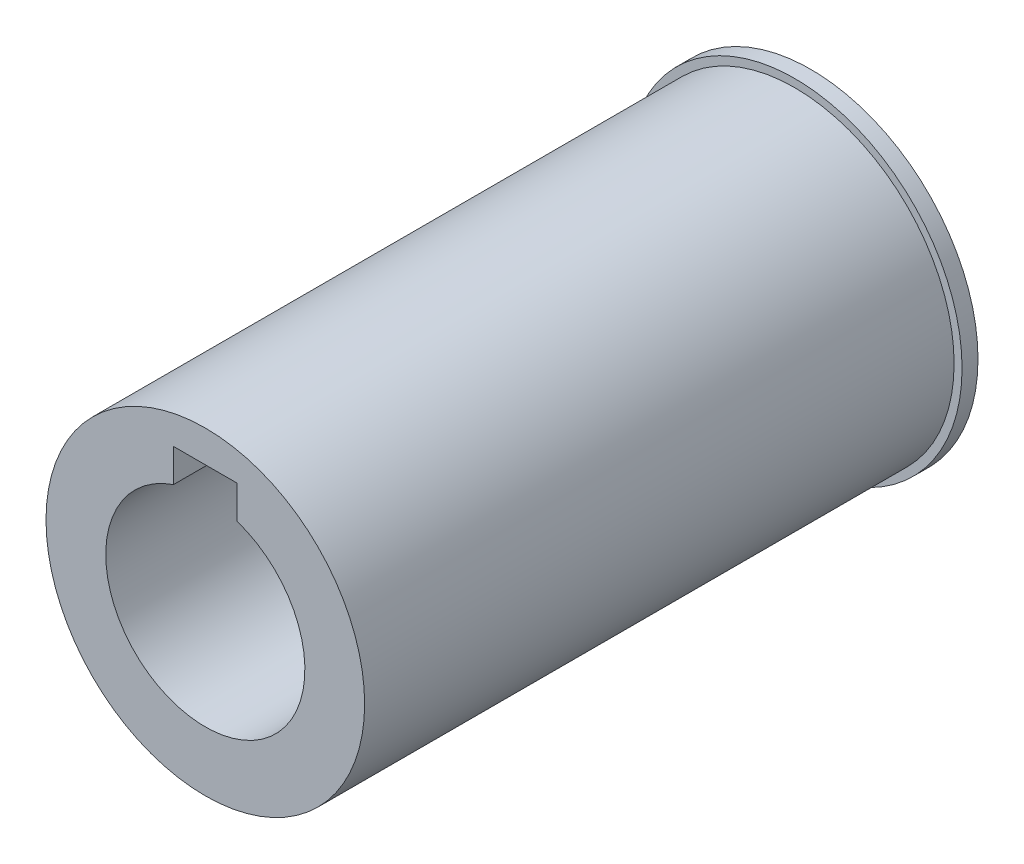
ISO-10303-21;
HEADER;
FILE_DESCRIPTION(('STEP AP214'),'2;1');
FILE_NAME('part.step','',(''),(''),'','','');
FILE_SCHEMA(('AUTOMOTIVE_DESIGN { 1 0 10303 214 1 1 1 1 }'));
ENDSEC;
DATA;
#1=APPLICATION_CONTEXT('core data for automotive mechanical design processes');
#2=APPLICATION_PROTOCOL_DEFINITION('international standard','automotive_design',2000,#1);
#3=PRODUCT_CONTEXT('',#1,'mechanical');
#4=PRODUCT('Part','Part','',(#3));
#5=PRODUCT_RELATED_PRODUCT_CATEGORY('part','',(#4));
#6=PRODUCT_DEFINITION_FORMATION('','',#4);
#7=PRODUCT_DEFINITION_CONTEXT('part definition',#1,'design');
#8=PRODUCT_DEFINITION('design','',#6,#7);
#9=PRODUCT_DEFINITION_SHAPE('','',#8);
#10=(LENGTH_UNIT() NAMED_UNIT(*) SI_UNIT(.MILLI.,.METRE.));
#11=(NAMED_UNIT(*) PLANE_ANGLE_UNIT() SI_UNIT($,.RADIAN.));
#12=(NAMED_UNIT(*) SI_UNIT($,.STERADIAN.) SOLID_ANGLE_UNIT());
#13=UNCERTAINTY_MEASURE_WITH_UNIT(LENGTH_MEASURE(1.E-05),#10,'distance_accuracy_value','');
#14=(GEOMETRIC_REPRESENTATION_CONTEXT(3) GLOBAL_UNCERTAINTY_ASSIGNED_CONTEXT((#13)) GLOBAL_UNIT_ASSIGNED_CONTEXT((#10,
#11,#12)) REPRESENTATION_CONTEXT('',''));
#15=CARTESIAN_POINT('',(0.,0.,0.));
#16=DIRECTION('',(0.,0.,1.));
#17=DIRECTION('',(1.,0.,0.));
#18=AXIS2_PLACEMENT_3D('',#15,#16,#17);
#19=CARTESIAN_POINT('',(0.,0.,2.));
#20=DIRECTION('',(0.,0.,-1.));
#21=DIRECTION('',(-1.,0.,0.));
#22=AXIS2_PLACEMENT_3D('',#19,#20,#21);
#23=CYLINDRICAL_SURFACE('',#22,21.);
#24=CARTESIAN_POINT('',(0.,0.,2.));
#25=DIRECTION('',(0.,0.,1.));
#26=DIRECTION('',(1.,0.,0.));
#27=AXIS2_PLACEMENT_3D('',#24,#25,#26);
#28=CIRCLE('',#27,21.);
#29=CARTESIAN_POINT('',(21.,0.,2.));
#30=VERTEX_POINT('',#29);
#31=EDGE_CURVE('E141',#30,#30,#28,.T.);
#32=ORIENTED_EDGE('',*,*,#31,.F.);
#33=EDGE_LOOP('',(#32));
#34=FACE_BOUND('',#33,.T.);
#35=CARTESIAN_POINT('',(0.,0.,0.));
#36=DIRECTION('',(0.,0.,1.));
#37=DIRECTION('',(1.,0.,0.));
#38=AXIS2_PLACEMENT_3D('',#35,#36,#37);
#39=CIRCLE('',#38,21.);
#40=CARTESIAN_POINT('',(21.,0.,0.));
#41=VERTEX_POINT('',#40);
#42=EDGE_CURVE('E135',#41,#41,#39,.T.);
#43=ORIENTED_EDGE('',*,*,#42,.T.);
#44=EDGE_LOOP('',(#43));
#45=FACE_BOUND('',#44,.T.);
#46=ADVANCED_FACE('F45',(#34,#45),#23,.T.);
#47=CARTESIAN_POINT('',(0.,0.,2.));
#48=DIRECTION('',(0.,0.,1.));
#49=DIRECTION('',(1.,0.,0.));
#50=AXIS2_PLACEMENT_3D('',#47,#48,#49);
#51=PLANE('',#50);
#52=CARTESIAN_POINT('',(0.,0.,2.));
#53=DIRECTION('',(0.,0.,1.));
#54=DIRECTION('',(1.,0.,0.));
#55=AXIS2_PLACEMENT_3D('',#52,#53,#54);
#56=CIRCLE('',#55,20.);
#57=CARTESIAN_POINT('',(20.,0.,2.));
#58=VERTEX_POINT('',#57);
#59=EDGE_CURVE('E136',#58,#58,#56,.T.);
#60=ORIENTED_EDGE('',*,*,#59,.F.);
#61=EDGE_LOOP('',(#60));
#62=FACE_BOUND('',#61,.T.);
#63=ORIENTED_EDGE('',*,*,#31,.T.);
#64=EDGE_LOOP('',(#63));
#65=FACE_BOUND('',#64,.T.);
#66=ADVANCED_FACE('F186',(#62,#65),#51,.T.);
#67=CARTESIAN_POINT('',(0.,0.,0.));
#68=DIRECTION('',(0.,0.,1.));
#69=DIRECTION('',(1.,0.,0.));
#70=AXIS2_PLACEMENT_3D('',#67,#68,#69);
#71=PLANE('',#70);
#72=CARTESIAN_POINT('',(0.,0.,0.));
#73=DIRECTION('',(0.,0.,-1.));
#74=DIRECTION('',(-1.,0.,0.));
#75=AXIS2_PLACEMENT_3D('',#72,#73,#74);
#76=CIRCLE('',#75,12.5);
#77=CARTESIAN_POINT('',(4.,11.842719282327,0.));
#78=VERTEX_POINT('',#77);
#79=CARTESIAN_POINT('',(-4.,11.842719282327,0.));
#80=VERTEX_POINT('',#79);
#81=EDGE_CURVE('E124',#78,#80,#76,.T.);
#82=ORIENTED_EDGE('',*,*,#81,.F.);
#83=DIRECTION('',(0.,-1.,0.));
#84=VECTOR('',#83,1.);
#85=CARTESIAN_POINT('',(4.,9.,0.));
#86=LINE('',#85,#84);
#87=CARTESIAN_POINT('',(4.,16.,0.));
#88=VERTEX_POINT('',#87);
#89=EDGE_CURVE('E73',#88,#78,#86,.T.);
#90=ORIENTED_EDGE('',*,*,#89,.F.);
#91=DIRECTION('',(1.,0.,0.));
#92=VECTOR('',#91,1.);
#93=CARTESIAN_POINT('',(4.,16.,0.));
#94=LINE('',#93,#92);
#95=CARTESIAN_POINT('',(-4.,16.,0.));
#96=VERTEX_POINT('',#95);
#97=EDGE_CURVE('E106',#96,#88,#94,.T.);
#98=ORIENTED_EDGE('',*,*,#97,.F.);
#99=DIRECTION('',(0.,1.,0.));
#100=VECTOR('',#99,1.);
#101=CARTESIAN_POINT('',(-4.,9.,0.));
#102=LINE('',#101,#100);
#103=EDGE_CURVE('E117',#80,#96,#102,.T.);
#104=ORIENTED_EDGE('',*,*,#103,.F.);
#105=EDGE_LOOP('',(#82,#90,#98,#104));
#106=FACE_BOUND('',#105,.T.);
#107=ORIENTED_EDGE('',*,*,#42,.F.);
#108=EDGE_LOOP('',(#107));
#109=FACE_BOUND('',#108,.T.);
#110=ADVANCED_FACE('F155',(#106,#109),#71,.F.);
#111=CARTESIAN_POINT('',(0.,0.,76.));
#112=DIRECTION('',(0.,0.,-1.));
#113=DIRECTION('',(-1.,0.,0.));
#114=AXIS2_PLACEMENT_3D('',#111,#112,#113);
#115=CYLINDRICAL_SURFACE('',#114,20.);
#116=CARTESIAN_POINT('',(0.,-20.,53.5));
#117=CARTESIAN_POINT('',(-0.139841095555761,-19.9999980489643,53.5000059409357));
#118=CARTESIAN_POINT('',(-0.279769574302746,-19.998517845549,53.5117728791693));
#119=CARTESIAN_POINT('',(-0.555732802089751,-19.9927554011136,53.5585277545708));
#120=CARTESIAN_POINT('',(-0.691763330623743,-19.9884702344143,53.5935399379234));
#121=CARTESIAN_POINT('',(-0.95589557481305,-19.9775806104441,53.6857376439141));
#122=CARTESIAN_POINT('',(-1.08400256014613,-19.9709777145554,53.7429082418099));
#123=CARTESIAN_POINT('',(-1.32877947489303,-19.956187008781,53.8777672839698));
#124=CARTESIAN_POINT('',(-1.44545136155637,-19.9479994708412,53.9554522085307));
#125=CARTESIAN_POINT('',(-1.66471281693131,-19.9309032130633,54.1295919498396));
#126=CARTESIAN_POINT('',(-1.76723036493712,-19.9219911469242,54.2261371293462));
#127=CARTESIAN_POINT('',(-1.95465279355749,-19.9044772600975,54.4350628235366));
#128=CARTESIAN_POINT('',(-2.03955677639225,-19.8958754552427,54.5474441449132));
#129=CARTESIAN_POINT('',(-2.18961016128393,-19.8799230561959,54.7853199775657));
#130=CARTESIAN_POINT('',(-2.25469209594107,-19.8725767717791,54.9108573615679));
#131=CARTESIAN_POINT('',(-2.36282307657511,-19.8600112845768,55.1711870519474));
#132=CARTESIAN_POINT('',(-2.40587295806521,-19.8547920011314,55.305979007147));
#133=CARTESIAN_POINT('',(-2.46849898002476,-19.8471033960361,55.5802441955868));
#134=CARTESIAN_POINT('',(-2.48819671473169,-19.8446198343674,55.7196892577042));
#135=CARTESIAN_POINT('',(-2.50393554955722,-19.8426402814279,55.9999262634718));
#136=CARTESIAN_POINT('',(-2.49997760100241,-19.8431441700151,56.1407181527313));
#137=CARTESIAN_POINT('',(-2.4686172364479,-19.8470695536975,56.4188048272488));
#138=CARTESIAN_POINT('',(-2.44134876298469,-19.8504743796033,56.5561149862002));
#139=CARTESIAN_POINT('',(-2.36435038318205,-19.8597919975763,56.824195021219));
#140=CARTESIAN_POINT('',(-2.3146200217519,-19.8657048404572,56.954964764714));
#141=CARTESIAN_POINT('',(-2.19396555991164,-19.8793911586465,57.2066679990217));
#142=CARTESIAN_POINT('',(-2.12298325370763,-19.8871697321144,57.327573300249));
#143=CARTESIAN_POINT('',(-1.96188146945692,-19.903707114306,57.5558066944132));
#144=CARTESIAN_POINT('',(-1.87176111608077,-19.9124659678566,57.6631341659737));
#145=CARTESIAN_POINT('',(-1.67419911075378,-19.9300510989042,57.8619427107227));
#146=CARTESIAN_POINT('',(-1.56664200784001,-19.9388774238689,57.953309091766));
#147=CARTESIAN_POINT('',(-1.33765716911392,-19.9555463255585,58.1167088800305));
#148=CARTESIAN_POINT('',(-1.21622940131825,-19.9633889000151,58.188742242672));
#149=CARTESIAN_POINT('',(-0.962861671363477,-19.9772115221858,58.3114313204639));
#150=CARTESIAN_POINT('',(-0.830918195337713,-19.9831909440154,58.3620798538812));
#151=CARTESIAN_POINT('',(-0.560307940431053,-19.9926078578006,58.4404704935232));
#152=CARTESIAN_POINT('',(-0.421641476630664,-19.9960454687587,58.468213672137));
#153=CARTESIAN_POINT('',(-0.142513163913495,-19.9999759641076,58.4998574242605));
#154=CARTESIAN_POINT('',(-0.00206949019860618,-20.0004883614264,58.5039159923641));
#155=CARTESIAN_POINT('',(0.277496036497495,-19.9985633800543,58.488492265944));
#156=CARTESIAN_POINT('',(0.416617917564705,-19.9961260641821,58.4690104727484));
#157=CARTESIAN_POINT('',(0.68912450772152,-19.9885876875669,58.4071902912256));
#158=CARTESIAN_POINT('',(0.822526570424704,-19.9834954081387,58.3649272365974));
#159=CARTESIAN_POINT('',(1.0803496548584,-19.971217231002,58.2588225480871));
#160=CARTESIAN_POINT('',(1.20477037146531,-19.9640312622062,58.1949801815086));
#161=CARTESIAN_POINT('',(1.44180452068742,-19.9483182291011,58.0471468624925));
#162=CARTESIAN_POINT('',(1.55435375994381,-19.9397844404251,57.9630537101944));
#163=CARTESIAN_POINT('',(1.76379698962631,-19.9223514232566,57.7772505024658));
#164=CARTESIAN_POINT('',(1.86069035833685,-19.913452180269,57.675539747749));
#165=CARTESIAN_POINT('',(2.03663195881801,-19.8962310546258,57.4566925832429));
#166=CARTESIAN_POINT('',(2.11557546056793,-19.8879127472133,57.3394716536896));
#167=CARTESIAN_POINT('',(2.2526528894435,-19.8728541103715,57.0933417551453));
#168=CARTESIAN_POINT('',(2.31078723372836,-19.8661137493103,56.9644330205235));
#169=CARTESIAN_POINT('',(2.40442657886654,-19.8549985039299,56.6989246808524));
#170=CARTESIAN_POINT('',(2.4399906274571,-19.8506174518479,56.562346169952));
#171=CARTESIAN_POINT('',(2.48766999386784,-19.8446991590745,56.2850975162193));
#172=CARTESIAN_POINT('',(2.49978640253576,-19.8431617860878,56.144427564041));
#173=CARTESIAN_POINT('',(2.50020653608483,-19.8431087698246,55.8640310707953));
#174=CARTESIAN_POINT('',(2.48867479769927,-19.8445722475195,55.7243047516681));
#175=CARTESIAN_POINT('',(2.44247440484932,-19.850311145372,55.4487928706549));
#176=CARTESIAN_POINT('',(2.40780574790577,-19.8545865658308,55.3130073091912));
#177=CARTESIAN_POINT('',(2.31636707368965,-19.8654611577455,55.0492530432336));
#178=CARTESIAN_POINT('',(2.25960498097093,-19.8720594959278,54.9212815549782));
#179=CARTESIAN_POINT('',(2.1256069021503,-19.8868378324482,54.6766533459517));
#180=CARTESIAN_POINT('',(2.04837065950959,-19.8950178506041,54.5599967669802));
#181=CARTESIAN_POINT('',(1.87500633126584,-19.9121060475223,54.3404687746595));
#182=CARTESIAN_POINT('',(1.77875562577496,-19.9210187208403,54.237694539045));
#183=CARTESIAN_POINT('',(1.57035022696838,-19.938528315929,54.049693174832));
#184=CARTESIAN_POINT('',(1.45819178914156,-19.9471251627559,53.9644701892257));
#185=CARTESIAN_POINT('',(1.22066562085421,-19.9630705658675,53.8137146428947));
#186=CARTESIAN_POINT('',(1.09524927959617,-19.970414250783,53.7482581941007));
#187=CARTESIAN_POINT('',(0.835182902301278,-19.9829764907672,53.6394287570837));
#188=CARTESIAN_POINT('',(0.700543080870234,-19.9881973536958,53.5960317736465));
#189=CARTESIAN_POINT('',(0.471005771967923,-19.9946672032775,53.5429406618287));
#190=CARTESIAN_POINT('',(0.377555663516919,-19.9966572589545,53.5268610580179));
#191=CARTESIAN_POINT('',(0.189417063212433,-19.9993243132919,53.5053887543068));
#192=CARTESIAN_POINT('',(0.0947285804960265,-20.0000013216347,53.4999959756007));
#193=CARTESIAN_POINT('',(0.,-20.,53.5));
#194=B_SPLINE_CURVE_WITH_KNOTS('',3,(#116,#117,#118,#119,#120,#121,#122,#123,#124,#125,#126,
#127,#128,#129,#130,#131,#132,#133,#134,#135,#136,#137,#138,#139,#140,#141,#142,#143,#144,#145,
#146,#147,#148,#149,#150,#151,#152,#153,#154,#155,#156,#157,#158,#159,#160,#161,#162,#163,#164,
#165,#166,#167,#168,#169,#170,#171,#172,#173,#174,#175,#176,#177,#178,#179,#180,#181,#182,#183,
#184,#185,#186,#187,#188,#189,#190,#191,#192,#193),.UNSPECIFIED.,.T.,.F.,(4,2,2,2,2,2,2,2,2,2,2,
2,2,2,2,2,2,2,2,2,2,2,2,2,2,2,2,2,2,2,2,2,2,2,2,2,2,2,4),(0.,0.419177272776246,
0.838792460943425,1.25812550818176,1.67738665591073,2.09870813201843,2.5200510780001,
2.94281250318869,3.36555789496806,3.7860922528632,4.20660969884663,4.62472696441689,
5.0428527016624,5.46213426285532,5.88143500513637,6.30363478136414,6.72583553113112,
7.14817795731603,7.57050060903778,7.99000279391919,8.40949604501926,8.82761053893393,
9.24573923078945,9.66602402928418,10.0863255137509,10.5090197150757,10.9317054422154,
11.3532807428092,11.7748364301062,12.1934690120221,12.6121016387954,13.0305842470648,
13.4490720991226,13.8703523769183,14.2917319847001,14.7147140303685,15.1372349868403,
15.4211884318762,15.7051397830043),.UNSPECIFIED.);
#195=CARTESIAN_POINT('',(0.,-20.,53.5));
#196=VERTEX_POINT('',#195);
#197=EDGE_CURVE('E11',#196,#196,#194,.T.);
#198=ORIENTED_EDGE('',*,*,#197,.T.);
#199=EDGE_LOOP('',(#198));
#200=FACE_BOUND('',#199,.T.);
#201=CARTESIAN_POINT('',(0.,0.,76.));
#202=DIRECTION('',(0.,0.,1.));
#203=DIRECTION('',(1.,0.,0.));
#204=AXIS2_PLACEMENT_3D('',#201,#202,#203);
#205=CIRCLE('',#204,20.);
#206=CARTESIAN_POINT('',(20.,0.,76.));
#207=VERTEX_POINT('',#206);
#208=EDGE_CURVE('E128',#207,#207,#205,.T.);
#209=ORIENTED_EDGE('',*,*,#208,.F.);
#210=EDGE_LOOP('',(#209));
#211=FACE_BOUND('',#210,.T.);
#212=ORIENTED_EDGE('',*,*,#59,.T.);
#213=EDGE_LOOP('',(#212));
#214=FACE_BOUND('',#213,.T.);
#215=ADVANCED_FACE('F197',(#200,#211,#214),#115,.T.);
#216=CARTESIAN_POINT('',(0.,0.,76.));
#217=DIRECTION('',(0.,0.,1.));
#218=DIRECTION('',(1.,0.,0.));
#219=AXIS2_PLACEMENT_3D('',#216,#217,#218);
#220=PLANE('',#219);
#221=DIRECTION('',(0.,-1.,0.));
#222=VECTOR('',#221,1.);
#223=CARTESIAN_POINT('',(4.,9.,76.));
#224=LINE('',#223,#222);
#225=CARTESIAN_POINT('',(4.,16.,76.));
#226=VERTEX_POINT('',#225);
#227=CARTESIAN_POINT('',(4.,11.842719282327,76.));
#228=VERTEX_POINT('',#227);
#229=EDGE_CURVE('E90',#226,#228,#224,.T.);
#230=ORIENTED_EDGE('',*,*,#229,.T.);
#231=CARTESIAN_POINT('',(0.,0.,76.));
#232=DIRECTION('',(0.,0.,-1.));
#233=DIRECTION('',(-1.,0.,0.));
#234=AXIS2_PLACEMENT_3D('',#231,#232,#233);
#235=CIRCLE('',#234,12.5);
#236=CARTESIAN_POINT('',(-4.,11.842719282327,76.));
#237=VERTEX_POINT('',#236);
#238=EDGE_CURVE('E125',#228,#237,#235,.T.);
#239=ORIENTED_EDGE('',*,*,#238,.T.);
#240=DIRECTION('',(0.,1.,0.));
#241=VECTOR('',#240,1.);
#242=CARTESIAN_POINT('',(-4.,9.,76.));
#243=LINE('',#242,#241);
#244=CARTESIAN_POINT('',(-4.,16.,76.));
#245=VERTEX_POINT('',#244);
#246=EDGE_CURVE('E65',#237,#245,#243,.T.);
#247=ORIENTED_EDGE('',*,*,#246,.T.);
#248=DIRECTION('',(1.,0.,0.));
#249=VECTOR('',#248,1.);
#250=CARTESIAN_POINT('',(4.,16.,76.));
#251=LINE('',#250,#249);
#252=EDGE_CURVE('E104',#245,#226,#251,.T.);
#253=ORIENTED_EDGE('',*,*,#252,.T.);
#254=EDGE_LOOP('',(#230,#239,#247,#253));
#255=FACE_BOUND('',#254,.T.);
#256=ORIENTED_EDGE('',*,*,#208,.T.);
#257=EDGE_LOOP('',(#256));
#258=FACE_BOUND('',#257,.T.);
#259=ADVANCED_FACE('F109',(#255,#258),#220,.T.);
#260=CARTESIAN_POINT('',(0.,0.,76.));
#261=DIRECTION('',(0.,0.,-1.));
#262=DIRECTION('',(-1.,0.,0.));
#263=AXIS2_PLACEMENT_3D('',#260,#261,#262);
#264=CYLINDRICAL_SURFACE('',#263,12.5);
#265=CARTESIAN_POINT('',(0.,-12.5,53.5));
#266=CARTESIAN_POINT('',(0.138942266981583,-12.4999974395218,53.5000051112459));
#267=CARTESIAN_POINT('',(0.277949150503805,-12.4976596294558,53.5116221074191));
#268=CARTESIAN_POINT('',(0.552033769222547,-12.4885591405808,53.5577462502881));
#269=CARTESIAN_POINT('',(0.687108293853387,-12.4817929465047,53.5922715820038));
#270=CARTESIAN_POINT('',(0.94932576315828,-12.4645912319572,53.683103184052));
#271=CARTESIAN_POINT('',(1.07647616983283,-12.454159226918,53.7393885921117));
#272=CARTESIAN_POINT('',(1.31951997216056,-12.4307599508829,53.8720806187782));
#273=CARTESIAN_POINT('',(1.43541403768953,-12.4177928308927,53.948486039018));
#274=CARTESIAN_POINT('',(1.65423369328716,-12.3905541332492,54.1203462357286));
#275=CARTESIAN_POINT('',(1.7569848778963,-12.3762686376087,54.216020888478));
#276=CARTESIAN_POINT('',(1.94509189152006,-12.3481045113147,54.4232310409793));
#277=CARTESIAN_POINT('',(2.03044636192606,-12.3342259125106,54.5347677783378));
#278=CARTESIAN_POINT('',(2.18207938336904,-12.3083110453154,54.7717904825297));
#279=CARTESIAN_POINT('',(2.24817734716466,-12.2962926841237,54.8973941094909));
#280=CARTESIAN_POINT('',(2.35826416645076,-12.2756567014604,55.1582045475102));
#281=CARTESIAN_POINT('',(2.40225520609309,-12.267038744049,55.2934104083659));
#282=CARTESIAN_POINT('',(2.46631324971206,-12.2543201313051,55.5677109097698));
#283=CARTESIAN_POINT('',(2.48668624489694,-12.2501617526797,55.7067313603556));
#284=CARTESIAN_POINT('',(2.50388031931529,-12.2466593765157,55.9862745534109));
#285=CARTESIAN_POINT('',(2.50070380678374,-12.247314886696,56.1267971408004));
#286=CARTESIAN_POINT('',(2.47113643275454,-12.2533137787046,56.4031169700525));
#287=CARTESIAN_POINT('',(2.44509635060976,-12.2585863214691,56.5389535140683));
#288=CARTESIAN_POINT('',(2.37109471155762,-12.273113654,56.8042901916575));
#289=CARTESIAN_POINT('',(2.32313210775169,-12.2823686339445,56.9337900222975));
#290=CARTESIAN_POINT('',(2.20631195918679,-12.3038904625102,57.183788154259));
#291=CARTESIAN_POINT('',(2.13731537808028,-12.3161772453426,57.3042196989229));
#292=CARTESIAN_POINT('',(1.98048393643169,-12.3423654693266,57.531927124932));
#293=CARTESIAN_POINT('',(1.89264691089207,-12.3562670959591,57.6392014921279));
#294=CARTESIAN_POINT('',(1.69874983640146,-12.3844255310365,57.8395735061423));
#295=CARTESIAN_POINT('',(1.59239040303111,-12.3986842302726,57.9323814196478));
#296=CARTESIAN_POINT('',(1.36546256015502,-12.4257212178602,58.0988846157531));
#297=CARTESIAN_POINT('',(1.24489396844847,-12.4384994872243,58.1725796532339));
#298=CARTESIAN_POINT('',(0.992648467197298,-12.4611672540222,58.2988187730649));
#299=CARTESIAN_POINT('',(0.860954548963246,-12.4710522212068,58.3513297341113));
#300=CARTESIAN_POINT('',(0.59037244112166,-12.4867852246965,58.4334011850964));
#301=CARTESIAN_POINT('',(0.451485125181123,-12.4926337500133,58.4629644551841));
#302=CARTESIAN_POINT('',(0.172948514067877,-12.4995667966717,58.4978911344857));
#303=CARTESIAN_POINT('',(0.0333508208139418,-12.5007293663117,58.5036510488507));
#304=CARTESIAN_POINT('',(-0.244812335481784,-12.4983762982526,58.4918753526445));
#305=CARTESIAN_POINT('',(-0.383377856109481,-12.4948609235362,58.4743410516185));
#306=CARTESIAN_POINT('',(-0.654264149866349,-12.4835958002004,58.4168040661401));
#307=CARTESIAN_POINT('',(-0.786629870849754,-12.4758844101052,58.3770048287552));
#308=CARTESIAN_POINT('',(-1.04280906874916,-12.4570888015258,58.2762900433605));
#309=CARTESIAN_POINT('',(-1.16662190409385,-12.4460043303557,58.2153729133079));
#310=CARTESIAN_POINT('',(-1.40385293421554,-12.4214977883324,58.0732937733717));
#311=CARTESIAN_POINT('',(-1.51712531688047,-12.4080487609263,57.9918930474026));
#312=CARTESIAN_POINT('',(-1.72854504779801,-12.3803683707471,57.8114770219818));
#313=CARTESIAN_POINT('',(-1.8266907723269,-12.3661369242097,57.7124598340003));
#314=CARTESIAN_POINT('',(-2.00660147693544,-12.3382325889241,57.4978166202722));
#315=CARTESIAN_POINT('',(-2.08809425612163,-12.3245715058326,57.3819606394466));
#316=CARTESIAN_POINT('',(-2.23046355012801,-12.2996047949049,57.1379715966083));
#317=CARTESIAN_POINT('',(-2.29134088980725,-12.2882990728336,57.0098390260661));
#318=CARTESIAN_POINT('',(-2.39037960395489,-12.2694185146096,56.7455793846261));
#319=CARTESIAN_POINT('',(-2.42865874947762,-12.2618243718047,56.6094978969742));
#320=CARTESIAN_POINT('',(-2.48177162906798,-12.2511859198006,56.3326663662727));
#321=CARTESIAN_POINT('',(-2.49660842056277,-12.2481410172778,56.1919169344766));
#322=CARTESIAN_POINT('',(-2.50230227716866,-12.2469787407845,55.9124778386392));
#323=CARTESIAN_POINT('',(-2.49358947017723,-12.2487729797325,55.7737971276825));
#324=CARTESIAN_POINT('',(-2.45338076025015,-12.2568893371153,55.4999208752374));
#325=CARTESIAN_POINT('',(-2.42188504032324,-12.2632114191792,55.364725305763));
#326=CARTESIAN_POINT('',(-2.33719642124738,-12.279631605479,55.1019307218986));
#327=CARTESIAN_POINT('',(-2.28405626679335,-12.2897205254708,54.974314098744));
#328=CARTESIAN_POINT('',(-2.157636611504,-12.3125428743543,54.7297406981639));
#329=CARTESIAN_POINT('',(-2.0843554219372,-12.3252765249724,54.6127848156872));
#330=CARTESIAN_POINT('',(-1.91826478696603,-12.3522240130806,54.3907110696242));
#331=CARTESIAN_POINT('',(-1.82514471808795,-12.3664593227425,54.285828086831));
#332=CARTESIAN_POINT('',(-1.62266092253285,-12.3946520467989,54.0930344861771));
#333=CARTESIAN_POINT('',(-1.51329346788333,-12.4086093965796,54.0051277742068));
#334=CARTESIAN_POINT('',(-1.28004407272061,-12.4348458096993,53.8479133901339));
#335=CARTESIAN_POINT('',(-1.15602221107458,-12.4471057804812,53.7788099917999));
#336=CARTESIAN_POINT('',(-0.897915902351828,-12.468378127125,53.6625346935085));
#337=CARTESIAN_POINT('',(-0.763840652157812,-12.4773934284654,53.6153430261688));
#338=CARTESIAN_POINT('',(-0.524553722309446,-12.4894093148843,53.5533701298882));
#339=CARTESIAN_POINT('',(-0.420704160034459,-12.4933575789613,53.5333920157306));
#340=CARTESIAN_POINT('',(-0.211248813025166,-12.4986538534973,53.5067052191041));
#341=CARTESIAN_POINT('',(-0.105643084371547,-12.5000019468289,53.4999961137256));
#342=CARTESIAN_POINT('',(0.,-12.5,53.5));
#343=B_SPLINE_CURVE_WITH_KNOTS('',3,(#265,#266,#267,#268,#269,#270,#271,#272,#273,#274,#275,
#276,#277,#278,#279,#280,#281,#282,#283,#284,#285,#286,#287,#288,#289,#290,#291,#292,#293,#294,
#295,#296,#297,#298,#299,#300,#301,#302,#303,#304,#305,#306,#307,#308,#309,#310,#311,#312,#313,
#314,#315,#316,#317,#318,#319,#320,#321,#322,#323,#324,#325,#326,#327,#328,#329,#330,#331,#332,
#333,#334,#335,#336,#337,#338,#339,#340,#341,#342),.UNSPECIFIED.,.T.,.F.,(4,2,2,2,2,2,2,2,2,2,2,
2,2,2,2,2,2,2,2,2,2,2,2,2,2,2,2,2,2,2,2,2,2,2,2,2,2,2,4),(0.,0.416440326653145,
0.833211626728305,1.24958433812585,1.66593225557715,2.08733167528045,2.50876399186841,
2.93402987514805,3.35925373412993,3.77890462758967,4.19851260703062,4.61179317515695,
5.02509348134323,5.4411872550898,5.85732886874174,6.28095631228374,6.70458918849549,
7.12888187135058,7.55312314245088,7.97026839190661,8.38739019144667,8.80076134876806,
9.21416348040054,9.63262665083394,10.0511347086482,10.4760157144806,10.9008797180866,
11.323509525818,11.7460842082603,12.1609930641925,12.5758985873152,12.9897990313277,
13.4037341895466,13.8247019059785,14.2457663633232,14.6712374168909,15.0963238879379,
15.4129693822473,15.7296047842749),.UNSPECIFIED.);
#344=CARTESIAN_POINT('',(0.,-12.5,53.5));
#345=VERTEX_POINT('',#344);
#346=EDGE_CURVE('E158',#345,#345,#343,.T.);
#347=ORIENTED_EDGE('',*,*,#346,.T.);
#348=EDGE_LOOP('',(#347));
#349=FACE_BOUND('',#348,.T.);
#350=ORIENTED_EDGE('',*,*,#238,.F.);
#351=DIRECTION('',(0.,0.,-1.));
#352=VECTOR('',#351,1.);
#353=CARTESIAN_POINT('',(4.,11.842719282327,76.));
#354=LINE('',#353,#352);
#355=EDGE_CURVE('E58',#228,#78,#354,.T.);
#356=ORIENTED_EDGE('',*,*,#355,.T.);
#357=ORIENTED_EDGE('',*,*,#81,.T.);
#358=DIRECTION('',(0.,0.,-1.));
#359=VECTOR('',#358,1.);
#360=CARTESIAN_POINT('',(-4.,11.842719282327,76.));
#361=LINE('',#360,#359);
#362=EDGE_CURVE('E140',#80,#237,#361,.F.);
#363=ORIENTED_EDGE('',*,*,#362,.T.);
#364=EDGE_LOOP('',(#350,#356,#357,#363));
#365=FACE_BOUND('',#364,.T.);
#366=ADVANCED_FACE('F152',(#349,#365),#264,.F.);
#367=CARTESIAN_POINT('',(4.,9.,86.6301458127346));
#368=DIRECTION('',(1.,0.,0.));
#369=DIRECTION('',(0.,0.,-1.));
#370=AXIS2_PLACEMENT_3D('',#367,#368,#369);
#371=PLANE('',#370);
#372=ORIENTED_EDGE('',*,*,#229,.F.);
#373=DIRECTION('',(0.,0.,-1.));
#374=VECTOR('',#373,1.);
#375=CARTESIAN_POINT('',(4.,16.,86.6301458127346));
#376=LINE('',#375,#374);
#377=EDGE_CURVE('E93',#226,#88,#376,.T.);
#378=ORIENTED_EDGE('',*,*,#377,.T.);
#379=ORIENTED_EDGE('',*,*,#89,.T.);
#380=ORIENTED_EDGE('',*,*,#355,.F.);
#381=EDGE_LOOP('',(#372,#378,#379,#380));
#382=FACE_BOUND('',#381,.T.);
#383=ADVANCED_FACE('F92',(#382),#371,.F.);
#384=CARTESIAN_POINT('',(-4.,9.,86.6301458127346));
#385=DIRECTION('',(-1.,0.,0.));
#386=DIRECTION('',(0.,-1.,0.));
#387=AXIS2_PLACEMENT_3D('',#384,#385,#386);
#388=PLANE('',#387);
#389=ORIENTED_EDGE('',*,*,#103,.T.);
#390=DIRECTION('',(0.,0.,-1.));
#391=VECTOR('',#390,1.);
#392=CARTESIAN_POINT('',(-4.,16.,86.6301458127346));
#393=LINE('',#392,#391);
#394=EDGE_CURVE('E120',#245,#96,#393,.T.);
#395=ORIENTED_EDGE('',*,*,#394,.F.);
#396=ORIENTED_EDGE('',*,*,#246,.F.);
#397=ORIENTED_EDGE('',*,*,#362,.F.);
#398=EDGE_LOOP('',(#389,#395,#396,#397));
#399=FACE_BOUND('',#398,.T.);
#400=ADVANCED_FACE('F177',(#399),#388,.F.);
#401=CARTESIAN_POINT('',(4.,16.,86.6301458127346));
#402=DIRECTION('',(0.,1.,0.));
#403=DIRECTION('',(0.,0.,1.));
#404=AXIS2_PLACEMENT_3D('',#401,#402,#403);
#405=PLANE('',#404);
#406=ORIENTED_EDGE('',*,*,#394,.T.);
#407=ORIENTED_EDGE('',*,*,#97,.T.);
#408=ORIENTED_EDGE('',*,*,#377,.F.);
#409=ORIENTED_EDGE('',*,*,#252,.F.);
#410=EDGE_LOOP('',(#406,#407,#408,#409));
#411=FACE_BOUND('',#410,.T.);
#412=ADVANCED_FACE('F103',(#411),#405,.F.);
#413=CARTESIAN_POINT('',(0.,-20.,56.));
#414=DIRECTION('',(0.,-1.,0.));
#415=DIRECTION('',(0.,0.,-1.));
#416=AXIS2_PLACEMENT_3D('',#413,#414,#415);
#417=CYLINDRICAL_SURFACE('',#416,2.49999999999999);
#418=ORIENTED_EDGE('',*,*,#197,.F.);
#419=EDGE_LOOP('',(#418));
#420=FACE_BOUND('',#419,.T.);
#421=ORIENTED_EDGE('',*,*,#346,.F.);
#422=EDGE_LOOP('',(#421));
#423=FACE_BOUND('',#422,.T.);
#424=ADVANCED_FACE('F172',(#420,#423),#417,.F.);
#425=CLOSED_SHELL('',(#46,#66,#110,#215,#259,#366,#383,#400,#412,#424));
#426=MANIFOLD_SOLID_BREP('B2',#425);
#427=ADVANCED_BREP_SHAPE_REPRESENTATION('',(#18,#426),#14);
#428=SHAPE_DEFINITION_REPRESENTATION(#9,#427);
ENDSEC;
END-ISO-10303-21;
